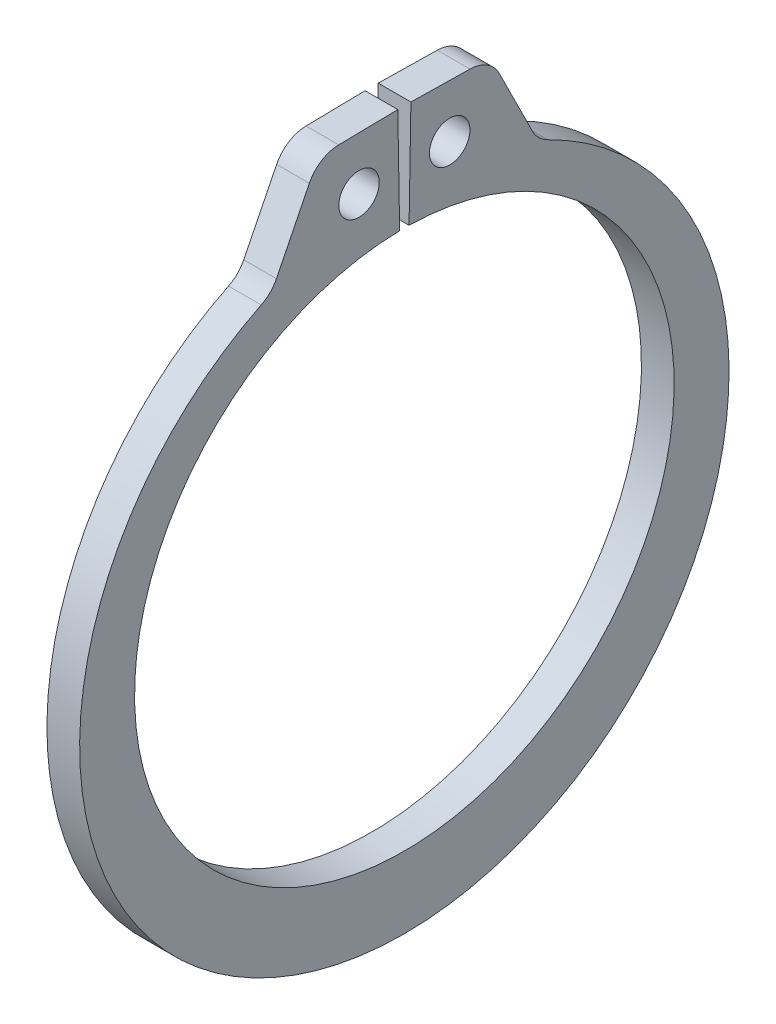
ISO-10303-21;
HEADER;
FILE_DESCRIPTION(('STEP AP214'),'2;1');
FILE_NAME('part.step','',(''),(''),'','','');
FILE_SCHEMA(('AUTOMOTIVE_DESIGN { 1 0 10303 214 1 1 1 1 }'));
ENDSEC;
DATA;
#1=APPLICATION_CONTEXT('core data for automotive mechanical design processes');
#2=APPLICATION_PROTOCOL_DEFINITION('international standard','automotive_design',2000,#1);
#3=PRODUCT_CONTEXT('',#1,'mechanical');
#4=PRODUCT('Part','Part','',(#3));
#5=PRODUCT_RELATED_PRODUCT_CATEGORY('part','',(#4));
#6=PRODUCT_DEFINITION_FORMATION('','',#4);
#7=PRODUCT_DEFINITION_CONTEXT('part definition',#1,'design');
#8=PRODUCT_DEFINITION('design','',#6,#7);
#9=PRODUCT_DEFINITION_SHAPE('','',#8);
#10=(LENGTH_UNIT() NAMED_UNIT(*) SI_UNIT(.MILLI.,.METRE.));
#11=(NAMED_UNIT(*) PLANE_ANGLE_UNIT() SI_UNIT($,.RADIAN.));
#12=(NAMED_UNIT(*) SI_UNIT($,.STERADIAN.) SOLID_ANGLE_UNIT());
#13=UNCERTAINTY_MEASURE_WITH_UNIT(LENGTH_MEASURE(1.E-05),#10,'distance_accuracy_value','');
#14=(GEOMETRIC_REPRESENTATION_CONTEXT(3) GLOBAL_UNCERTAINTY_ASSIGNED_CONTEXT((#13)) GLOBAL_UNIT_ASSIGNED_CONTEXT((#10,
#11,#12)) REPRESENTATION_CONTEXT('',''));
#15=CARTESIAN_POINT('',(0.,0.,0.));
#16=DIRECTION('',(0.,0.,1.));
#17=DIRECTION('',(1.,0.,0.));
#18=AXIS2_PLACEMENT_3D('',#15,#16,#17);
#19=CARTESIAN_POINT('',(0.533399999999989,0.,0.));
#20=DIRECTION('',(1.,0.,0.));
#21=DIRECTION('',(0.,0.,-1.));
#22=AXIS2_PLACEMENT_3D('',#19,#20,#21);
#23=PLANE('',#22);
#24=CARTESIAN_POINT('',(0.533399999999989,10.5040886416162,-1.47894687499924));
#25=DIRECTION('',(-1.,0.,0.));
#26=DIRECTION('',(0.,0.,1.));
#27=AXIS2_PLACEMENT_3D('',#24,#25,#26);
#28=CIRCLE('',#27,0.6604);
#29=CARTESIAN_POINT('',(0.533399999999989,10.5040886416162,-0.818546874999241));
#30=VERTEX_POINT('',#29);
#31=EDGE_CURVE('E108',#30,#30,#28,.T.);
#32=ORIENTED_EDGE('',*,*,#31,.T.);
#33=EDGE_LOOP('',(#32));
#34=FACE_BOUND('',#33,.T.);
#35=CARTESIAN_POINT('',(0.533399999999989,0.,0.));
#36=DIRECTION('',(-1.,0.,0.));
#37=DIRECTION('',(0.,0.,1.));
#38=AXIS2_PLACEMENT_3D('',#35,#36,#37);
#39=CIRCLE('',#38,8.8011);
#40=CARTESIAN_POINT('',(0.533399999999989,8.79975954984092,-0.153600374295177));
#41=VERTEX_POINT('',#40);
#42=CARTESIAN_POINT('',(0.533399999999989,8.79975954984092,0.153600374295175));
#43=VERTEX_POINT('',#42);
#44=EDGE_CURVE('E174',#41,#43,#39,.T.);
#45=ORIENTED_EDGE('',*,*,#44,.T.);
#46=DIRECTION('',(0.,-0.999847695156391,-0.0174524064372834));
#47=VECTOR('',#46,1.);
#48=CARTESIAN_POINT('',(0.533399999999989,8.79975954984091,0.153600374295175));
#49=LINE('',#48,#47);
#50=CARTESIAN_POINT('',(0.533399999999989,12.2536334279892,0.213887967092126));
#51=VERTEX_POINT('',#50);
#52=EDGE_CURVE('E124',#43,#51,#49,.F.);
#53=ORIENTED_EDGE('',*,*,#52,.T.);
#54=DIRECTION('',(0.,0.0174524064372834,-0.999847695156391));
#55=VECTOR('',#54,1.);
#56=CARTESIAN_POINT('',(0.533399999999989,12.2536334279892,0.213887967092126));
#57=LINE('',#56,#55);
#58=CARTESIAN_POINT('',(0.533399999999989,12.21999978275,2.14075821234738));
#59=VERTEX_POINT('',#58);
#60=EDGE_CURVE('E119',#51,#59,#57,.F.);
#61=ORIENTED_EDGE('',*,*,#60,.T.);
#62=CARTESIAN_POINT('',(0.533399999999989,11.1279661301002,2.12169669403658));
#63=DIRECTION('',(-1.,0.,0.));
#64=DIRECTION('',(0.,0.,1.));
#65=AXIS2_PLACEMENT_3D('',#62,#63,#64);
#66=CIRCLE('',#65,1.0922);
#67=CARTESIAN_POINT('',(0.533399999999989,11.6141614114107,3.09971253666458));
#68=VERTEX_POINT('',#67);
#69=EDGE_CURVE('E112',#68,#59,#66,.T.);
#70=ORIENTED_EDGE('',*,*,#69,.F.);
#71=DIRECTION('',(0.,0.895454900776411,-0.445152244378829));
#72=VECTOR('',#71,1.);
#73=CARTESIAN_POINT('',(0.533399999999989,12.2084177333914,2.80429337570331));
#74=LINE('',#73,#72);
#75=CARTESIAN_POINT('',(0.533399999999989,9.45539137797145,4.17288922557434));
#76=VERTEX_POINT('',#75);
#77=EDGE_CURVE('E107',#68,#76,#74,.F.);
#78=ORIENTED_EDGE('',*,*,#77,.T.);
#79=CARTESIAN_POINT('',(0.533399999999989,9.941586659282,5.15090506820234));
#80=DIRECTION('',(-1.,0.,0.));
#81=DIRECTION('',(0.,0.,1.));
#82=AXIS2_PLACEMENT_3D('',#79,#80,#81);
#83=CIRCLE('',#82,1.0922);
#84=CARTESIAN_POINT('',(0.533399999999989,8.96124610534802,4.66941442622431));
#85=VERTEX_POINT('',#84);
#86=EDGE_CURVE('E98',#76,#85,#83,.T.);
#87=ORIENTED_EDGE('',*,*,#86,.T.);
#88=CARTESIAN_POINT('',(0.533399999999989,-0.545929997486656,0.));
#89=DIRECTION('',(-1.,0.,0.));
#90=DIRECTION('',(0.,0.,1.));
#91=AXIS2_PLACEMENT_3D('',#88,#89,#90);
#92=CIRCLE('',#91,10.5919700025133);
#93=CARTESIAN_POINT('',(0.533399999999989,8.96124610534802,-4.66941442622431));
#94=VERTEX_POINT('',#93);
#95=EDGE_CURVE('E181',#94,#85,#92,.T.);
#96=ORIENTED_EDGE('',*,*,#95,.F.);
#97=CARTESIAN_POINT('',(0.533399999999989,9.941586659282,-5.15090506820234));
#98=DIRECTION('',(-1.,0.,0.));
#99=DIRECTION('',(0.,0.,1.));
#100=AXIS2_PLACEMENT_3D('',#97,#98,#99);
#101=CIRCLE('',#100,1.0922);
#102=CARTESIAN_POINT('',(0.533399999999989,9.45539137797145,-4.17288922557434));
#103=VERTEX_POINT('',#102);
#104=EDGE_CURVE('E178',#94,#103,#101,.T.);
#105=ORIENTED_EDGE('',*,*,#104,.T.);
#106=DIRECTION('',(0.,-0.895454900776411,-0.445152244378829));
#107=VECTOR('',#106,1.);
#108=CARTESIAN_POINT('',(0.533399999999989,12.2084177333914,-2.80429337570331));
#109=LINE('',#108,#107);
#110=CARTESIAN_POINT('',(0.533399999999989,11.6141614114107,-3.09971253666458));
#111=VERTEX_POINT('',#110);
#112=EDGE_CURVE('E143',#103,#111,#109,.F.);
#113=ORIENTED_EDGE('',*,*,#112,.T.);
#114=CARTESIAN_POINT('',(0.533399999999989,11.1279661301002,-2.12169669403658));
#115=DIRECTION('',(-1.,0.,0.));
#116=DIRECTION('',(0.,0.,1.));
#117=AXIS2_PLACEMENT_3D('',#114,#115,#116);
#118=CIRCLE('',#117,1.0922);
#119=CARTESIAN_POINT('',(0.533399999999989,12.21999978275,-2.14075821234738));
#120=VERTEX_POINT('',#119);
#121=EDGE_CURVE('E145',#120,#111,#118,.T.);
#122=ORIENTED_EDGE('',*,*,#121,.F.);
#123=DIRECTION('',(0.,-0.0174524064372835,-0.999847695156391));
#124=VECTOR('',#123,1.);
#125=CARTESIAN_POINT('',(0.533399999999989,12.2536334279892,-0.213887967092127));
#126=LINE('',#125,#124);
#127=CARTESIAN_POINT('',(0.533399999999989,12.2536334279892,-0.213887967092128));
#128=VERTEX_POINT('',#127);
#129=EDGE_CURVE('E137',#120,#128,#126,.F.);
#130=ORIENTED_EDGE('',*,*,#129,.T.);
#131=DIRECTION('',(0.,0.999847695156391,-0.0174524064372835));
#132=VECTOR('',#131,1.);
#133=CARTESIAN_POINT('',(0.533399999999989,8.79975954984091,-0.153600374295177));
#134=LINE('',#133,#132);
#135=EDGE_CURVE('E130',#128,#41,#134,.F.);
#136=ORIENTED_EDGE('',*,*,#135,.T.);
#137=EDGE_LOOP('',(#45,#53,#61,#70,#78,#87,#96,#105,#113,#122,#130,#136));
#138=FACE_BOUND('',#137,.T.);
#139=CARTESIAN_POINT('',(0.533399999999989,10.5040886416162,1.47894687499924));
#140=DIRECTION('',(-1.,0.,0.));
#141=DIRECTION('',(0.,0.,1.));
#142=AXIS2_PLACEMENT_3D('',#139,#140,#141);
#143=CIRCLE('',#142,0.6604);
#144=CARTESIAN_POINT('',(0.533399999999989,10.5040886416162,2.13934687499924));
#145=VERTEX_POINT('',#144);
#146=EDGE_CURVE('E20',#145,#145,#143,.T.);
#147=ORIENTED_EDGE('',*,*,#146,.T.);
#148=EDGE_LOOP('',(#147));
#149=FACE_BOUND('',#148,.T.);
#150=ADVANCED_FACE('F17',(#34,#138,#149),#23,.T.);
#151=CARTESIAN_POINT('',(0.533399999999989,10.5040886416162,1.47894687499924));
#152=DIRECTION('',(-1.,0.,0.));
#153=DIRECTION('',(0.,0.,1.));
#154=AXIS2_PLACEMENT_3D('',#151,#152,#153);
#155=CYLINDRICAL_SURFACE('',#154,0.6604);
#156=CARTESIAN_POINT('',(-0.533399999999989,10.5040886416162,1.47894687499924));
#157=DIRECTION('',(-1.,0.,0.));
#158=DIRECTION('',(0.,0.,1.));
#159=AXIS2_PLACEMENT_3D('',#156,#157,#158);
#160=CIRCLE('',#159,0.6604);
#161=CARTESIAN_POINT('',(-0.533399999999989,10.5040886416162,2.13934687499924));
#162=VERTEX_POINT('',#161);
#163=EDGE_CURVE('E168',#162,#162,#160,.T.);
#164=ORIENTED_EDGE('',*,*,#163,.T.);
#165=EDGE_LOOP('',(#164));
#166=FACE_BOUND('',#165,.T.);
#167=ORIENTED_EDGE('',*,*,#146,.F.);
#168=EDGE_LOOP('',(#167));
#169=FACE_BOUND('',#168,.T.);
#170=ADVANCED_FACE('F361',(#166,#169),#155,.F.);
#171=CARTESIAN_POINT('',(0.533399999999989,9.941586659282,5.15090506820234));
#172=DIRECTION('',(-1.,0.,0.));
#173=DIRECTION('',(0.,0.,1.));
#174=AXIS2_PLACEMENT_3D('',#171,#172,#173);
#175=CYLINDRICAL_SURFACE('',#174,1.0922);
#176=DIRECTION('',(1.,0.,0.));
#177=VECTOR('',#176,1.);
#178=CARTESIAN_POINT('',(0.533399999999989,9.45539137797145,4.17288922557434));
#179=LINE('',#178,#177);
#180=CARTESIAN_POINT('',(-0.533399999999989,9.45539137797145,4.17288922557434));
#181=VERTEX_POINT('',#180);
#182=EDGE_CURVE('E102',#76,#181,#179,.F.);
#183=ORIENTED_EDGE('',*,*,#182,.T.);
#184=CARTESIAN_POINT('',(-0.533399999999989,9.941586659282,5.15090506820234));
#185=DIRECTION('',(-1.,0.,0.));
#186=DIRECTION('',(0.,0.,1.));
#187=AXIS2_PLACEMENT_3D('',#184,#185,#186);
#188=CIRCLE('',#187,1.0922);
#189=CARTESIAN_POINT('',(-0.533399999999989,8.96124610534802,4.66941442622431));
#190=VERTEX_POINT('',#189);
#191=EDGE_CURVE('E166',#181,#190,#188,.T.);
#192=ORIENTED_EDGE('',*,*,#191,.T.);
#193=DIRECTION('',(-1.,0.,0.));
#194=VECTOR('',#193,1.);
#195=CARTESIAN_POINT('',(0.533399999999989,8.96124610534802,4.66941442622431));
#196=LINE('',#195,#194);
#197=EDGE_CURVE('E103',#85,#190,#196,.T.);
#198=ORIENTED_EDGE('',*,*,#197,.F.);
#199=ORIENTED_EDGE('',*,*,#86,.F.);
#200=EDGE_LOOP('',(#183,#192,#198,#199));
#201=FACE_BOUND('',#200,.T.);
#202=ADVANCED_FACE('F100',(#201),#175,.F.);
#203=CARTESIAN_POINT('',(0.533399999999989,-0.545929997486656,0.));
#204=DIRECTION('',(-1.,0.,0.));
#205=DIRECTION('',(0.,0.,1.));
#206=AXIS2_PLACEMENT_3D('',#203,#204,#205);
#207=CYLINDRICAL_SURFACE('',#206,10.5919700025133);
#208=CARTESIAN_POINT('',(-0.533399999999989,-0.545929997486656,0.));
#209=DIRECTION('',(-1.,0.,0.));
#210=DIRECTION('',(0.,0.,1.));
#211=AXIS2_PLACEMENT_3D('',#208,#209,#210);
#212=CIRCLE('',#211,10.5919700025133);
#213=CARTESIAN_POINT('',(-0.533399999999989,8.96124610534802,-4.66941442622431));
#214=VERTEX_POINT('',#213);
#215=EDGE_CURVE('E164',#190,#214,#212,.F.);
#216=ORIENTED_EDGE('',*,*,#215,.T.);
#217=DIRECTION('',(-1.,0.,0.));
#218=VECTOR('',#217,1.);
#219=CARTESIAN_POINT('',(0.533399999999989,8.96124610534802,-4.66941442622431));
#220=LINE('',#219,#218);
#221=EDGE_CURVE('E180',#214,#94,#220,.F.);
#222=ORIENTED_EDGE('',*,*,#221,.T.);
#223=ORIENTED_EDGE('',*,*,#95,.T.);
#224=ORIENTED_EDGE('',*,*,#197,.T.);
#225=EDGE_LOOP('',(#216,#222,#223,#224));
#226=FACE_BOUND('',#225,.T.);
#227=ADVANCED_FACE('F186',(#226),#207,.T.);
#228=CARTESIAN_POINT('',(0.533399999999989,9.941586659282,-5.15090506820234));
#229=DIRECTION('',(-1.,0.,0.));
#230=DIRECTION('',(0.,0.,1.));
#231=AXIS2_PLACEMENT_3D('',#228,#229,#230);
#232=CYLINDRICAL_SURFACE('',#231,1.0922);
#233=ORIENTED_EDGE('',*,*,#221,.F.);
#234=CARTESIAN_POINT('',(-0.533399999999989,9.941586659282,-5.15090506820234));
#235=DIRECTION('',(-1.,0.,0.));
#236=DIRECTION('',(0.,0.,1.));
#237=AXIS2_PLACEMENT_3D('',#234,#235,#236);
#238=CIRCLE('',#237,1.0922);
#239=CARTESIAN_POINT('',(-0.533399999999989,9.45539137797145,-4.17288922557434));
#240=VERTEX_POINT('',#239);
#241=EDGE_CURVE('E161',#214,#240,#238,.T.);
#242=ORIENTED_EDGE('',*,*,#241,.T.);
#243=DIRECTION('',(1.,0.,0.));
#244=VECTOR('',#243,1.);
#245=CARTESIAN_POINT('',(0.533399999999989,9.45539137797145,-4.17288922557434));
#246=LINE('',#245,#244);
#247=EDGE_CURVE('E146',#240,#103,#246,.T.);
#248=ORIENTED_EDGE('',*,*,#247,.T.);
#249=ORIENTED_EDGE('',*,*,#104,.F.);
#250=EDGE_LOOP('',(#233,#242,#248,#249));
#251=FACE_BOUND('',#250,.T.);
#252=ADVANCED_FACE('F198',(#251),#232,.F.);
#253=CARTESIAN_POINT('',(0.533399999999989,12.2084177333914,-2.80429337570331));
#254=DIRECTION('',(0.,-0.445152244378829,0.895454900776411));
#255=DIRECTION('',(0.,-0.895454900776411,-0.445152244378829));
#256=AXIS2_PLACEMENT_3D('',#253,#254,#255);
#257=PLANE('',#256);
#258=ORIENTED_EDGE('',*,*,#247,.F.);
#259=DIRECTION('',(0.,0.89545490077641,0.445152244378829));
#260=VECTOR('',#259,1.);
#261=CARTESIAN_POINT('',(-0.533399999999989,9.45539137797145,-4.17288922557434));
#262=LINE('',#261,#260);
#263=CARTESIAN_POINT('',(-0.533399999999989,11.6141614114107,-3.09971253666458));
#264=VERTEX_POINT('',#263);
#265=EDGE_CURVE('E160',#240,#264,#262,.T.);
#266=ORIENTED_EDGE('',*,*,#265,.T.);
#267=DIRECTION('',(-1.,0.,0.));
#268=VECTOR('',#267,1.);
#269=CARTESIAN_POINT('',(0.533399999999989,11.6141614114107,-3.09971253666458));
#270=LINE('',#269,#268);
#271=EDGE_CURVE('E177',#111,#264,#270,.T.);
#272=ORIENTED_EDGE('',*,*,#271,.F.);
#273=ORIENTED_EDGE('',*,*,#112,.F.);
#274=EDGE_LOOP('',(#258,#266,#272,#273));
#275=FACE_BOUND('',#274,.T.);
#276=ADVANCED_FACE('F203',(#275),#257,.F.);
#277=CARTESIAN_POINT('',(0.533399999999989,11.1279661301002,-2.12169669403658));
#278=DIRECTION('',(-1.,0.,0.));
#279=DIRECTION('',(0.,0.,1.));
#280=AXIS2_PLACEMENT_3D('',#277,#278,#279);
#281=CYLINDRICAL_SURFACE('',#280,1.0922);
#282=CARTESIAN_POINT('',(-0.533399999999989,11.1279661301002,-2.12169669403658));
#283=DIRECTION('',(-1.,0.,0.));
#284=DIRECTION('',(0.,0.,1.));
#285=AXIS2_PLACEMENT_3D('',#282,#283,#284);
#286=CIRCLE('',#285,1.0922);
#287=CARTESIAN_POINT('',(-0.533399999999989,12.21999978275,-2.14075821234738));
#288=VERTEX_POINT('',#287);
#289=EDGE_CURVE('E156',#264,#288,#286,.F.);
#290=ORIENTED_EDGE('',*,*,#289,.T.);
#291=DIRECTION('',(1.,0.,0.));
#292=VECTOR('',#291,1.);
#293=CARTESIAN_POINT('',(0.533399999999989,12.21999978275,-2.14075821234738));
#294=LINE('',#293,#292);
#295=EDGE_CURVE('E140',#288,#120,#294,.T.);
#296=ORIENTED_EDGE('',*,*,#295,.T.);
#297=ORIENTED_EDGE('',*,*,#121,.T.);
#298=ORIENTED_EDGE('',*,*,#271,.T.);
#299=EDGE_LOOP('',(#290,#296,#297,#298));
#300=FACE_BOUND('',#299,.T.);
#301=ADVANCED_FACE('F266',(#300),#281,.T.);
#302=CARTESIAN_POINT('',(0.533399999999989,12.2536334279892,-0.213887967092127));
#303=DIRECTION('',(0.,-0.999847695156391,0.0174524064372835));
#304=DIRECTION('',(0.,-0.0174524064372835,-0.999847695156391));
#305=AXIS2_PLACEMENT_3D('',#302,#303,#304);
#306=PLANE('',#305);
#307=ORIENTED_EDGE('',*,*,#295,.F.);
#308=DIRECTION('',(0.,0.0174524064372837,0.999847695156391));
#309=VECTOR('',#308,1.);
#310=CARTESIAN_POINT('',(-0.533399999999989,12.21999978275,-2.14075821234738));
#311=LINE('',#310,#309);
#312=CARTESIAN_POINT('',(-0.533399999999989,12.2536334279892,-0.213887967092128));
#313=VERTEX_POINT('',#312);
#314=EDGE_CURVE('E159',#288,#313,#311,.T.);
#315=ORIENTED_EDGE('',*,*,#314,.T.);
#316=DIRECTION('',(1.,0.,0.));
#317=VECTOR('',#316,1.);
#318=CARTESIAN_POINT('',(0.533399999999989,12.2536334279892,-0.213887967092129));
#319=LINE('',#318,#317);
#320=EDGE_CURVE('E134',#313,#128,#319,.T.);
#321=ORIENTED_EDGE('',*,*,#320,.T.);
#322=ORIENTED_EDGE('',*,*,#129,.F.);
#323=EDGE_LOOP('',(#307,#315,#321,#322));
#324=FACE_BOUND('',#323,.T.);
#325=ADVANCED_FACE('F264',(#324),#306,.F.);
#326=CARTESIAN_POINT('',(0.533399999999989,8.79975954984091,-0.153600374295177));
#327=DIRECTION('',(0.,-0.0174524064372835,-0.999847695156391));
#328=DIRECTION('',(0.,0.999847695156391,-0.0174524064372835));
#329=AXIS2_PLACEMENT_3D('',#326,#327,#328);
#330=PLANE('',#329);
#331=DIRECTION('',(-1.,0.,0.));
#332=VECTOR('',#331,1.);
#333=CARTESIAN_POINT('',(0.533399999999989,8.79975954984092,-0.153600374295178));
#334=LINE('',#333,#332);
#335=CARTESIAN_POINT('',(-0.533399999999989,8.79975954984092,-0.153600374295177));
#336=VERTEX_POINT('',#335);
#337=EDGE_CURVE('E133',#336,#41,#334,.F.);
#338=ORIENTED_EDGE('',*,*,#337,.T.);
#339=ORIENTED_EDGE('',*,*,#135,.F.);
#340=ORIENTED_EDGE('',*,*,#320,.F.);
#341=DIRECTION('',(0.,-0.999847695156391,0.017452406437283));
#342=VECTOR('',#341,1.);
#343=CARTESIAN_POINT('',(-0.533399999999989,12.2536334279892,-0.213887967092127));
#344=LINE('',#343,#342);
#345=EDGE_CURVE('E155',#313,#336,#344,.T.);
#346=ORIENTED_EDGE('',*,*,#345,.T.);
#347=EDGE_LOOP('',(#338,#339,#340,#346));
#348=FACE_BOUND('',#347,.T.);
#349=ADVANCED_FACE('F259',(#348),#330,.F.);
#350=CARTESIAN_POINT('',(0.533399999999989,0.,0.));
#351=DIRECTION('',(-1.,0.,0.));
#352=DIRECTION('',(0.,0.,1.));
#353=AXIS2_PLACEMENT_3D('',#350,#351,#352);
#354=CYLINDRICAL_SURFACE('',#353,8.8011);
#355=ORIENTED_EDGE('',*,*,#44,.F.);
#356=ORIENTED_EDGE('',*,*,#337,.F.);
#357=CARTESIAN_POINT('',(-0.533399999999989,0.,0.));
#358=DIRECTION('',(-1.,0.,0.));
#359=DIRECTION('',(0.,0.,1.));
#360=AXIS2_PLACEMENT_3D('',#357,#358,#359);
#361=CIRCLE('',#360,8.8011);
#362=CARTESIAN_POINT('',(-0.533399999999989,8.79975954984092,0.153600374295175));
#363=VERTEX_POINT('',#362);
#364=EDGE_CURVE('E152',#336,#363,#361,.T.);
#365=ORIENTED_EDGE('',*,*,#364,.T.);
#366=DIRECTION('',(1.,0.,0.));
#367=VECTOR('',#366,1.);
#368=CARTESIAN_POINT('',(0.533399999999989,8.79975954984091,0.153600374295175));
#369=LINE('',#368,#367);
#370=EDGE_CURVE('E127',#363,#43,#369,.T.);
#371=ORIENTED_EDGE('',*,*,#370,.T.);
#372=EDGE_LOOP('',(#355,#356,#365,#371));
#373=FACE_BOUND('',#372,.T.);
#374=ADVANCED_FACE('F254',(#373),#354,.F.);
#375=CARTESIAN_POINT('',(0.533399999999989,8.79975954984091,0.153600374295175));
#376=DIRECTION('',(0.,-0.0174524064372834,0.999847695156391));
#377=DIRECTION('',(0.,-0.999847695156391,-0.0174524064372834));
#378=AXIS2_PLACEMENT_3D('',#375,#376,#377);
#379=PLANE('',#378);
#380=DIRECTION('',(1.,0.,0.));
#381=VECTOR('',#380,1.);
#382=CARTESIAN_POINT('',(0.533399999999989,12.2536334279892,0.213887967092126));
#383=LINE('',#382,#381);
#384=CARTESIAN_POINT('',(-0.533399999999989,12.2536334279892,0.213887967092126));
#385=VERTEX_POINT('',#384);
#386=EDGE_CURVE('E121',#385,#51,#383,.T.);
#387=ORIENTED_EDGE('',*,*,#386,.T.);
#388=ORIENTED_EDGE('',*,*,#52,.F.);
#389=ORIENTED_EDGE('',*,*,#370,.F.);
#390=DIRECTION('',(0.,0.999847695156391,0.0174524064372833));
#391=VECTOR('',#390,1.);
#392=CARTESIAN_POINT('',(-0.533399999999989,8.79975954984091,0.153600374295175));
#393=LINE('',#392,#391);
#394=EDGE_CURVE('E154',#363,#385,#393,.T.);
#395=ORIENTED_EDGE('',*,*,#394,.T.);
#396=EDGE_LOOP('',(#387,#388,#389,#395));
#397=FACE_BOUND('',#396,.T.);
#398=ADVANCED_FACE('F251',(#397),#379,.F.);
#399=CARTESIAN_POINT('',(0.533399999999989,12.2536334279892,0.213887967092126));
#400=DIRECTION('',(0.,-0.999847695156391,-0.0174524064372834));
#401=DIRECTION('',(0.,0.0174524064372834,-0.999847695156391));
#402=AXIS2_PLACEMENT_3D('',#399,#400,#401);
#403=PLANE('',#402);
#404=DIRECTION('',(-1.,0.,0.));
#405=VECTOR('',#404,1.);
#406=CARTESIAN_POINT('',(0.533399999999989,12.21999978275,2.14075821234738));
#407=LINE('',#406,#405);
#408=CARTESIAN_POINT('',(-0.533399999999989,12.21999978275,2.14075821234738));
#409=VERTEX_POINT('',#408);
#410=EDGE_CURVE('E114',#59,#409,#407,.T.);
#411=ORIENTED_EDGE('',*,*,#410,.F.);
#412=ORIENTED_EDGE('',*,*,#60,.F.);
#413=ORIENTED_EDGE('',*,*,#386,.F.);
#414=DIRECTION('',(0.,-0.0174524064372828,0.999847695156391));
#415=VECTOR('',#414,1.);
#416=CARTESIAN_POINT('',(-0.533399999999989,12.2536334279892,0.213887967092126));
#417=LINE('',#416,#415);
#418=EDGE_CURVE('E151',#385,#409,#417,.T.);
#419=ORIENTED_EDGE('',*,*,#418,.T.);
#420=EDGE_LOOP('',(#411,#412,#413,#419));
#421=FACE_BOUND('',#420,.T.);
#422=ADVANCED_FACE('F244',(#421),#403,.F.);
#423=CARTESIAN_POINT('',(0.533399999999989,11.1279661301002,2.12169669403658));
#424=DIRECTION('',(-1.,0.,0.));
#425=DIRECTION('',(0.,0.,1.));
#426=AXIS2_PLACEMENT_3D('',#423,#424,#425);
#427=CYLINDRICAL_SURFACE('',#426,1.0922);
#428=CARTESIAN_POINT('',(-0.533399999999989,11.1279661301002,2.12169669403658));
#429=DIRECTION('',(-1.,0.,0.));
#430=DIRECTION('',(0.,0.,1.));
#431=AXIS2_PLACEMENT_3D('',#428,#429,#430);
#432=CIRCLE('',#431,1.0922);
#433=CARTESIAN_POINT('',(-0.533399999999989,11.6141614114107,3.09971253666458));
#434=VERTEX_POINT('',#433);
#435=EDGE_CURVE('E148',#409,#434,#432,.F.);
#436=ORIENTED_EDGE('',*,*,#435,.T.);
#437=DIRECTION('',(1.,0.,0.));
#438=VECTOR('',#437,1.);
#439=CARTESIAN_POINT('',(0.533399999999989,11.6141614114107,3.09971253666458));
#440=LINE('',#439,#438);
#441=EDGE_CURVE('E35',#434,#68,#440,.T.);
#442=ORIENTED_EDGE('',*,*,#441,.T.);
#443=ORIENTED_EDGE('',*,*,#69,.T.);
#444=ORIENTED_EDGE('',*,*,#410,.T.);
#445=EDGE_LOOP('',(#436,#442,#443,#444));
#446=FACE_BOUND('',#445,.T.);
#447=ADVANCED_FACE('F289',(#446),#427,.T.);
#448=CARTESIAN_POINT('',(0.533399999999989,12.2084177333914,2.80429337570331));
#449=DIRECTION('',(0.,-0.445152244378829,-0.895454900776411));
#450=DIRECTION('',(0.,0.895454900776411,-0.445152244378829));
#451=AXIS2_PLACEMENT_3D('',#448,#449,#450);
#452=PLANE('',#451);
#453=ORIENTED_EDGE('',*,*,#182,.F.);
#454=ORIENTED_EDGE('',*,*,#77,.F.);
#455=ORIENTED_EDGE('',*,*,#441,.F.);
#456=DIRECTION('',(0.,-0.895454900776411,0.445152244378828));
#457=VECTOR('',#456,1.);
#458=CARTESIAN_POINT('',(-0.533399999999989,11.6141614114107,3.09971253666458));
#459=LINE('',#458,#457);
#460=EDGE_CURVE('E26',#434,#181,#459,.T.);
#461=ORIENTED_EDGE('',*,*,#460,.T.);
#462=EDGE_LOOP('',(#453,#454,#455,#461));
#463=FACE_BOUND('',#462,.T.);
#464=ADVANCED_FACE('F106',(#463),#452,.F.);
#465=CARTESIAN_POINT('',(0.533399999999989,10.5040886416162,-1.47894687499924));
#466=DIRECTION('',(-1.,0.,0.));
#467=DIRECTION('',(0.,0.,1.));
#468=AXIS2_PLACEMENT_3D('',#465,#466,#467);
#469=CYLINDRICAL_SURFACE('',#468,0.6604);
#470=CARTESIAN_POINT('',(-0.533399999999989,10.5040886416162,-1.47894687499924));
#471=DIRECTION('',(-1.,0.,0.));
#472=DIRECTION('',(0.,0.,1.));
#473=AXIS2_PLACEMENT_3D('',#470,#471,#472);
#474=CIRCLE('',#473,0.6604);
#475=CARTESIAN_POINT('',(-0.533399999999989,10.5040886416162,-0.818546874999241));
#476=VERTEX_POINT('',#475);
#477=EDGE_CURVE('E10',#476,#476,#474,.T.);
#478=ORIENTED_EDGE('',*,*,#477,.T.);
#479=EDGE_LOOP('',(#478));
#480=FACE_BOUND('',#479,.T.);
#481=ORIENTED_EDGE('',*,*,#31,.F.);
#482=EDGE_LOOP('',(#481));
#483=FACE_BOUND('',#482,.T.);
#484=ADVANCED_FACE('F277',(#480,#483),#469,.F.);
#485=CARTESIAN_POINT('',(-0.533399999999989,0.,0.));
#486=DIRECTION('',(1.,0.,0.));
#487=DIRECTION('',(0.,0.,-1.));
#488=AXIS2_PLACEMENT_3D('',#485,#486,#487);
#489=PLANE('',#488);
#490=ORIENTED_EDGE('',*,*,#477,.F.);
#491=EDGE_LOOP('',(#490));
#492=FACE_BOUND('',#491,.T.);
#493=ORIENTED_EDGE('',*,*,#435,.F.);
#494=ORIENTED_EDGE('',*,*,#418,.F.);
#495=ORIENTED_EDGE('',*,*,#394,.F.);
#496=ORIENTED_EDGE('',*,*,#364,.F.);
#497=ORIENTED_EDGE('',*,*,#345,.F.);
#498=ORIENTED_EDGE('',*,*,#314,.F.);
#499=ORIENTED_EDGE('',*,*,#289,.F.);
#500=ORIENTED_EDGE('',*,*,#265,.F.);
#501=ORIENTED_EDGE('',*,*,#241,.F.);
#502=ORIENTED_EDGE('',*,*,#215,.F.);
#503=ORIENTED_EDGE('',*,*,#191,.F.);
#504=ORIENTED_EDGE('',*,*,#460,.F.);
#505=EDGE_LOOP('',(#493,#494,#495,#496,#497,#498,#499,#500,#501,#502,#503,#504));
#506=FACE_BOUND('',#505,.T.);
#507=ORIENTED_EDGE('',*,*,#163,.F.);
#508=EDGE_LOOP('',(#507));
#509=FACE_BOUND('',#508,.T.);
#510=ADVANCED_FACE('F191',(#492,#506,#509),#489,.F.);
#511=CLOSED_SHELL('',(#150,#170,#202,#227,#252,#276,#301,#325,#349,#374,#398,#422,#447,#464,
#484,#510));
#512=MANIFOLD_SOLID_BREP('B1',#511);
#513=ADVANCED_BREP_SHAPE_REPRESENTATION('',(#18,#512),#14);
#514=SHAPE_DEFINITION_REPRESENTATION(#9,#513);
ENDSEC;
END-ISO-10303-21;
